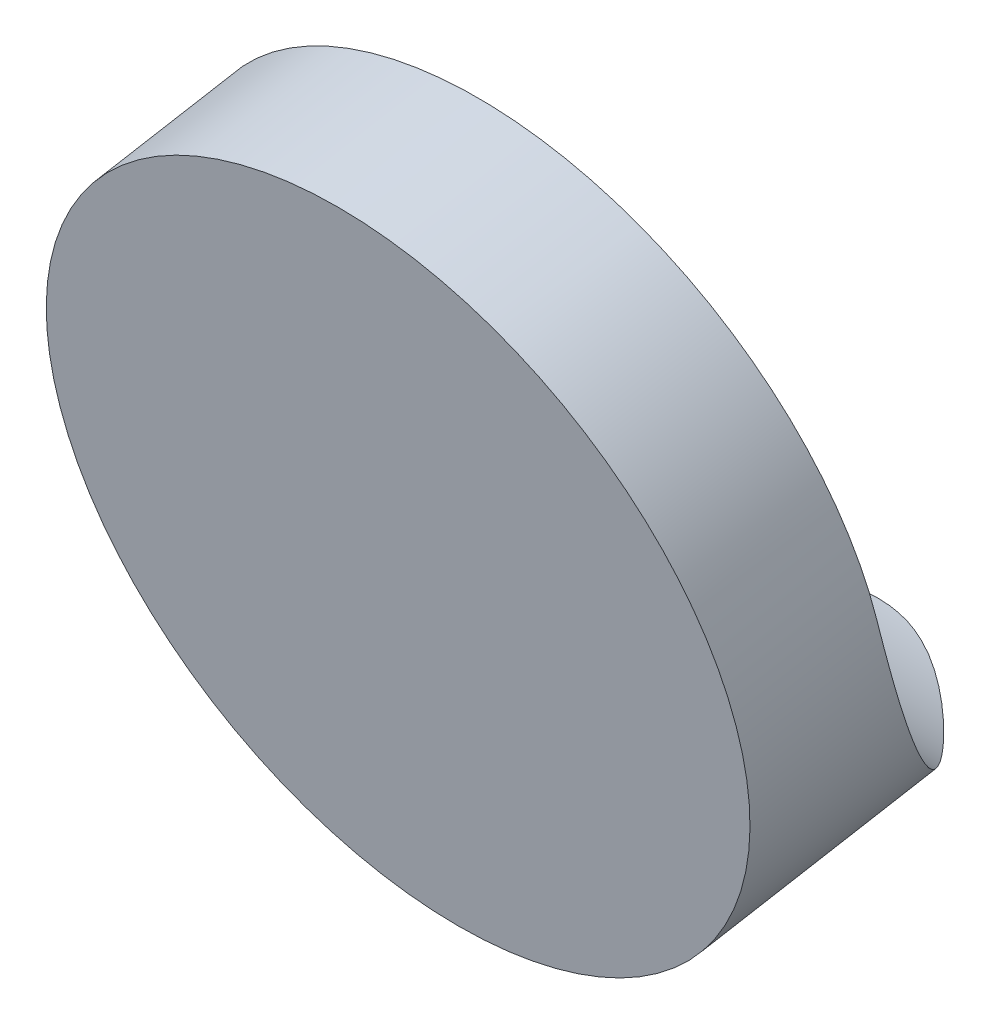
ISO-10303-21;
HEADER;
FILE_DESCRIPTION(('STEP AP214'),'2;1');
FILE_NAME('part.step','',(''),(''),'','','');
FILE_SCHEMA(('AUTOMOTIVE_DESIGN { 1 0 10303 214 1 1 1 1 }'));
ENDSEC;
DATA;
#1=APPLICATION_CONTEXT('core data for automotive mechanical design processes');
#2=APPLICATION_PROTOCOL_DEFINITION('international standard','automotive_design',2000,#1);
#3=PRODUCT_CONTEXT('',#1,'mechanical');
#4=PRODUCT('Part','Part','',(#3));
#5=PRODUCT_RELATED_PRODUCT_CATEGORY('part','',(#4));
#6=PRODUCT_DEFINITION_FORMATION('','',#4);
#7=PRODUCT_DEFINITION_CONTEXT('part definition',#1,'design');
#8=PRODUCT_DEFINITION('design','',#6,#7);
#9=PRODUCT_DEFINITION_SHAPE('','',#8);
#10=(LENGTH_UNIT() NAMED_UNIT(*) SI_UNIT(.MILLI.,.METRE.));
#11=(NAMED_UNIT(*) PLANE_ANGLE_UNIT() SI_UNIT($,.RADIAN.));
#12=(NAMED_UNIT(*) SI_UNIT($,.STERADIAN.) SOLID_ANGLE_UNIT());
#13=UNCERTAINTY_MEASURE_WITH_UNIT(LENGTH_MEASURE(1.E-05),#10,'distance_accuracy_value','');
#14=(GEOMETRIC_REPRESENTATION_CONTEXT(3) GLOBAL_UNCERTAINTY_ASSIGNED_CONTEXT((#13)) GLOBAL_UNIT_ASSIGNED_CONTEXT((#10,
#11,#12)) REPRESENTATION_CONTEXT('',''));
#15=CARTESIAN_POINT('',(0.,0.,0.));
#16=DIRECTION('',(0.,0.,1.));
#17=DIRECTION('',(1.,0.,0.));
#18=AXIS2_PLACEMENT_3D('',#15,#16,#17);
#19=CARTESIAN_POINT('',(0.,88.3379145341021,-14.4271454362242));
#20=DIRECTION('',(0.,-0.173648177666923,0.984807753012209));
#21=DIRECTION('',(0.,-0.984807753012209,-0.173648177666923));
#22=AXIS2_PLACEMENT_3D('',#19,#20,#21);
#23=CYLINDRICAL_SURFACE('',#22,12.1999999999991);
#24=CARTESIAN_POINT('',(0.,85.7331918690982,0.344970858958972));
#25=DIRECTION('',(0.,-0.173648177666923,0.984807753012209));
#26=DIRECTION('',(0.,-0.984807753012209,-0.173648177666923));
#27=AXIS2_PLACEMENT_3D('',#24,#25,#26);
#28=CIRCLE('',#27,12.1999999999991);
#29=CARTESIAN_POINT('',(0.,73.7185372823501,-1.77353690857734));
#30=VERTEX_POINT('',#29);
#31=EDGE_CURVE('E47',#30,#30,#28,.T.);
#32=ORIENTED_EDGE('',*,*,#31,.F.);
#33=EDGE_LOOP('',(#32));
#34=FACE_BOUND('',#33,.T.);
#35=CARTESIAN_POINT('',(-12.1392072190051,87.7993606537095,-4.36784089704516));
#36=CARTESIAN_POINT('',(-12.1532147196582,87.6617115130478,-4.3921102562988));
#37=CARTESIAN_POINT('',(-12.1648023392377,87.5242069828366,-4.41848405272386));
#38=CARTESIAN_POINT('',(-12.1831343314049,87.2497465147514,-4.47541503495586));
#39=CARTESIAN_POINT('',(-12.1898788478009,87.1127905607085,-4.50597209651527));
#40=CARTESIAN_POINT('',(-12.2028369467568,86.7033309161728,-4.60383245392506));
#41=CARTESIAN_POINT('',(-12.2017964778567,86.432024421312,-4.67736207144266));
#42=CARTESIAN_POINT('',(-12.1807432267052,85.896997937094,-4.83978371267855));
#43=CARTESIAN_POINT('',(-12.1608672385769,85.6332373624002,-4.92856119462065));
#44=CARTESIAN_POINT('',(-12.1029964482111,85.1132006475448,-5.12093408547772));
#45=CARTESIAN_POINT('',(-12.0650003523064,84.8569250431519,-5.22453055200966));
#46=CARTESIAN_POINT('',(-11.9719079080006,84.3540838444365,-5.44516344204128));
#47=CARTESIAN_POINT('',(-11.9168458240349,84.1074998995306,-5.56217264195061));
#48=CARTESIAN_POINT('',(-11.7906849013815,83.6247283913672,-5.80856583368056));
#49=CARTESIAN_POINT('',(-11.7195789621823,83.3885454867694,-5.93795528997052));
#50=CARTESIAN_POINT('',(-11.5624738405449,82.9274041591296,-6.20788165959979));
#51=CARTESIAN_POINT('',(-11.4764568473072,82.7024595786483,-6.34843179396612));
#52=CARTESIAN_POINT('',(-11.2908432159911,82.2647382895209,-6.63921468073627));
#53=CARTESIAN_POINT('',(-11.1912435798152,82.0519642820456,-6.78944956698459));
#54=CARTESIAN_POINT('',(-10.9416551262953,81.5647326066916,-7.15385581507834));
#55=CARTESIAN_POINT('',(-10.7864256472619,81.2956070892344,-7.37159186032811));
#56=CARTESIAN_POINT('',(-10.4560702176334,80.7809982511047,-7.81954977623964));
#57=CARTESIAN_POINT('',(-10.2809380189792,80.5355223997054,-8.04977555588238));
#58=CARTESIAN_POINT('',(-9.91300144550046,80.0675941223839,-8.52047225825681));
#59=CARTESIAN_POINT('',(-9.72016163657196,79.8451898440885,-8.7609631842616));
#60=CARTESIAN_POINT('',(-9.31933391960637,79.4234717681597,-9.24932772435853));
#61=CARTESIAN_POINT('',(-9.11134606512789,79.2241578888925,-9.49720131234612));
#62=CARTESIAN_POINT('',(-8.60650453268886,78.7817103189891,-10.0863230773509));
#63=CARTESIAN_POINT('',(-8.30410996503959,78.5477964185715,-10.42976979092));
#64=CARTESIAN_POINT('',(-7.67804531380005,78.1186893138486,-11.121556765579));
#65=CARTESIAN_POINT('',(-7.35436447936685,77.9235158788875,-11.4698994284931));
#66=CARTESIAN_POINT('',(-6.6878997214513,77.5700654107804,-12.1662335599352));
#67=CARTESIAN_POINT('',(-6.3451368774455,77.4117486271407,-12.5142250000115));
#68=CARTESIAN_POINT('',(-5.8165134672815,77.2002950872541,-13.0316524079355));
#69=CARTESIAN_POINT('',(-5.63792334007993,77.1341563395947,-13.2033401117431));
#70=CARTESIAN_POINT('',(-5.27558446252668,77.0102738429707,-13.5442718793158));
#71=CARTESIAN_POINT('',(-5.09183632082159,76.9525291084382,-13.713516227858));
#72=CARTESIAN_POINT('',(-4.74668480757552,76.8532343954932,-14.0232201193758));
#73=CARTESIAN_POINT('',(-4.58606310968275,76.8105544277281,-14.1641900185487));
#74=CARTESIAN_POINT('',(-4.26028923074735,76.7309277551912,-14.4424380218246));
#75=CARTESIAN_POINT('',(-4.09513767385148,76.6939802651932,-14.5797166294217));
#76=CARTESIAN_POINT('',(-3.75951388158822,76.6256344518497,-14.8492853980446));
#77=CARTESIAN_POINT('',(-3.58903863624341,76.5942393371478,-14.9815726401194));
#78=CARTESIAN_POINT('',(-3.24195107930801,76.5368636331836,-15.2390777455546));
#79=CARTESIAN_POINT('',(-3.06533986956069,76.5108820776048,-15.3642968676551));
#80=CARTESIAN_POINT('',(-2.75247960904164,76.4703468550823,-15.5728872969137));
#81=CARTESIAN_POINT('',(-2.61793481937623,76.4545892517229,-15.6585558161919));
#82=CARTESIAN_POINT('',(-2.34430668325694,76.4258318302516,-15.8227864492657));
#83=CARTESIAN_POINT('',(-2.20522205679382,76.4128327978067,-15.9013465348681));
#84=CARTESIAN_POINT('',(-1.7808865671191,76.3779432357145,-16.1227984251094));
#85=CARTESIAN_POINT('',(-1.48755663323038,76.360030686579,-16.252164119243));
#86=CARTESIAN_POINT('',(-0.992550283748176,76.3392285033612,-16.4120328380209));
#87=CARTESIAN_POINT('',(-0.797223959322686,76.3332311537889,-16.461407414295));
#88=CARTESIAN_POINT('',(-0.401203491795373,76.3252520152862,-16.5281580537634));
#89=CARTESIAN_POINT('',(-0.200523385709996,76.3232606051127,-16.5456107759148));
#90=CARTESIAN_POINT('',(0.115810628638701,76.3232595674708,-16.5456777076129));
#91=CARTESIAN_POINT('',(0.231568982493763,76.3239232119778,-16.5398949297691));
#92=CARTESIAN_POINT('',(0.461984245955879,76.3265765083573,-16.5172071708003));
#93=CARTESIAN_POINT('',(0.576640962883281,76.3285663880588,-16.5003002787114));
#94=CARTESIAN_POINT('',(0.91816689471674,76.3365528392362,-16.4340920970007));
#95=CARTESIAN_POINT('',(1.14204824082874,76.3445663047542,-16.3693102229857));
#96=CARTESIAN_POINT('',(1.53369487485018,76.3638600430325,-16.2258630247861));
#97=CARTESIAN_POINT('',(1.70364977414743,76.3741514385332,-16.1526578398676));
#98=CARTESIAN_POINT('',(2.03661780871444,76.3982986517417,-15.9921413800035));
#99=CARTESIAN_POINT('',(2.19962505279264,76.4121574269415,-15.9048184233424));
#100=CARTESIAN_POINT('',(2.51975677611042,76.4435846488423,-15.7196617637248));
#101=CARTESIAN_POINT('',(2.67686162643433,76.4611643707283,-15.6217965687001));
#102=CARTESIAN_POINT('',(2.9856467708908,76.5001243382196,-15.4184915544067));
#103=CARTESIAN_POINT('',(3.1373249662179,76.5215060355865,-15.3130488509083));
#104=CARTESIAN_POINT('',(3.46065462292729,76.5720271737053,-15.0787036353592));
#105=CARTESIAN_POINT('',(3.63146948721318,76.6018645892881,-14.9488019681971));
#106=CARTESIAN_POINT('',(3.96769701001425,76.6669970043188,-14.6835733187136));
#107=CARTESIAN_POINT('',(4.13311009743079,76.7022915691864,-14.548246769038));
#108=CARTESIAN_POINT('',(4.62272910783234,76.8166776112702,-14.1361686769587));
#109=CARTESIAN_POINT('',(4.94004156960469,76.9042288627746,-13.8535239489152));
#110=CARTESIAN_POINT('',(5.55993168092113,77.1031740595901,-13.2799527436829));
#111=CARTESIAN_POINT('',(5.8624914486387,77.2145960981536,-12.9890168615632));
#112=CARTESIAN_POINT('',(6.45363333649872,77.4623934789769,-12.4037962336705));
#113=CARTESIAN_POINT('',(6.7422202161618,77.598760247721,-12.109512670988));
#114=CARTESIAN_POINT('',(7.35421918443571,77.9235729782202,-11.4700110339199));
#115=CARTESIAN_POINT('',(7.67502822856237,78.1169466149961,-11.1247816165374));
#116=CARTESIAN_POINT('',(8.2959783297796,78.5419036592508,-10.4388619228328));
#117=CARTESIAN_POINT('',(8.59611148410627,78.7735015632589,-10.0981734218334));
#118=CARTESIAN_POINT('',(9.17158443907188,79.2760920813437,-9.42717145689885));
#119=CARTESIAN_POINT('',(9.44699545114632,79.5469652557178,-9.09683010350794));
#120=CARTESIAN_POINT('',(9.96946569535358,80.1301925583171,-8.4508118094942));
#121=CARTESIAN_POINT('',(10.2165466487552,80.4425145050576,-8.13512374592003));
#122=CARTESIAN_POINT('',(10.5873004039802,80.9798696043478,-7.64308290693653));
#123=CARTESIAN_POINT('',(10.7216326583525,81.1916928354121,-7.46023372105151));
#124=CARTESIAN_POINT('',(10.9760527353861,81.6310950460804,-7.10384596273683));
#125=CARTESIAN_POINT('',(11.0961449991361,81.8586690781606,-6.93030449676404));
#126=CARTESIAN_POINT('',(11.320467275012,82.3292957664818,-6.59419730050857));
#127=CARTESIAN_POINT('',(11.4246959661313,82.572349709393,-6.43163248491055));
#128=CARTESIAN_POINT('',(11.6155435226899,83.0732118258723,-6.11931819672197));
#129=CARTESIAN_POINT('',(11.7021625238028,83.3310198857482,-5.96956862540185));
#130=CARTESIAN_POINT('',(11.8568384292705,83.8629002344553,-5.68331671683774));
#131=CARTESIAN_POINT('',(11.9246984532991,84.1371108014801,-5.54696390702492));
#132=CARTESIAN_POINT('',(12.0390347215858,84.6976927413023,-5.29110357788109));
#133=CARTESIAN_POINT('',(12.0855073195868,84.9840661786155,-5.17159893333393));
#134=CARTESIAN_POINT('',(12.1555889420292,85.5658919501736,-4.95141637481812));
#135=CARTESIAN_POINT('',(12.1792528540603,85.8613207149817,-4.85069373714255));
#136=CARTESIAN_POINT('',(12.2029422919572,86.458972604113,-4.66910296403905));
#137=CARTESIAN_POINT('',(12.2029872097829,86.7611899508907,-4.58821859529233));
#138=CARTESIAN_POINT('',(12.1862521559688,87.1871695237682,-4.48934308490908));
#139=CARTESIAN_POINT('',(12.1795304971983,87.30943074611,-4.46269283598638));
#140=CARTESIAN_POINT('',(12.1622446655268,87.5542086586161,-4.4127558230143));
#141=CARTESIAN_POINT('',(12.1516852829297,87.6767248418018,-4.38946491619065));
#142=CARTESIAN_POINT('',(12.1392072190051,87.7993606537095,-4.36784089704516));
#143=B_SPLINE_CURVE_WITH_KNOTS('',3,(#35,#36,#37,#38,#39,#40,#41,#42,#43,#44,#45,#46,#47,#48,
#49,#50,#51,#52,#53,#54,#55,#56,#57,#58,#59,#60,#61,#62,#63,#64,#65,#66,#67,#68,#69,#70,#71,#72,
#73,#74,#75,#76,#77,#78,#79,#80,#81,#82,#83,#84,#85,#86,#87,#88,#89,#90,#91,#92,#93,#94,#95,#96,
#97,#98,#99,#100,#101,#102,#103,#104,#105,#106,#107,#108,#109,#110,#111,#112,#113,#114,#115,
#116,#117,#118,#119,#120,#121,#122,#123,#124,#125,#126,#127,#128,#129,#130,#131,#132,#133,#134,
#135,#136,#137,#138,#139,#140,#141,#142),.UNSPECIFIED.,.F.,.F.,(4,2,2,2,2,2,2,2,2,2,2,2,2,2,2,2,
2,2,2,2,2,2,2,2,2,2,2,2,2,2,2,2,2,2,2,2,2,2,2,2,2,2,2,2,2,2,2,2,2,2,2,2,2,4),(0.,
0.42134161326001,0.842670714929282,1.68468536786751,2.52063132772053,3.35663697804372,
4.19097488401445,5.02568276879957,5.86139464462093,6.6972912866496,7.83377021334464,
8.97060690549968,10.1097702330127,11.2489295330063,12.788465182023,14.3287844510138,
15.8674346839593,16.6365043466024,17.4054836372438,18.0591381835533,18.7127031140512,
19.3666445055838,20.0204690688473,20.5010582360684,20.9817840964337,21.9395738953877,
22.542180933774,23.1433389276938,23.4905327721447,23.8377862751142,24.5338981689605,
25.0891814126836,25.6449264981153,26.202380344584,26.7600475103773,27.409780664467,
28.0594621036552,29.3598551825541,30.6617871696381,31.9632725199851,33.4897283569214,
35.0167644371541,36.5392504447937,38.0605612112488,38.9910174109467,39.921182657645,
40.8514253196322,41.7816608143179,42.721317658381,43.6611346415087,44.5986843287752,
45.5354642561475,45.9113185244289,46.2867052480921),.UNSPECIFIED.);
#144=CARTESIAN_POINT('',(-12.1392072190051,87.7993606537095,-4.36784089704516));
#145=VERTEX_POINT('',#144);
#146=CARTESIAN_POINT('',(12.1392072190051,87.7993606537095,-4.36784089704516));
#147=VERTEX_POINT('',#146);
#148=EDGE_CURVE('E57',#145,#147,#143,.T.);
#149=ORIENTED_EDGE('',*,*,#148,.T.);
#150=CARTESIAN_POINT('',(0.,86.6014327574328,-4.57906790610206));
#151=DIRECTION('',(0.,0.173648177666922,-0.984807753012209));
#152=DIRECTION('',(0.,0.98480775301221,0.173648177666922));
#153=AXIS2_PLACEMENT_3D('',#150,#151,#152);
#154=CIRCLE('',#153,12.1999999999991);
#155=EDGE_CURVE('E11',#147,#145,#154,.F.);
#156=ORIENTED_EDGE('',*,*,#155,.T.);
#157=EDGE_LOOP('',(#149,#156));
#158=FACE_BOUND('',#157,.T.);
#159=ADVANCED_FACE('F39',(#34,#158),#23,.T.);
#160=CARTESIAN_POINT('',(0.,85.7331918690982,0.344970858958972));
#161=DIRECTION('',(0.,-0.173648177666923,0.984807753012209));
#162=DIRECTION('',(0.,-0.984807753012209,-0.173648177666923));
#163=AXIS2_PLACEMENT_3D('',#160,#161,#162);
#164=PLANE('',#163);
#165=ORIENTED_EDGE('',*,*,#31,.T.);
#166=EDGE_LOOP('',(#165));
#167=FACE_BOUND('',#166,.T.);
#168=ADVANCED_FACE('F71',(#167),#164,.T.);
#169=CARTESIAN_POINT('',(25.,90.2304351410464,-18.1551494392161));
#170=DIRECTION('',(-1.,0.,0.));
#171=DIRECTION('',(0.,0.,1.));
#172=AXIS2_PLACEMENT_3D('',#169,#170,#171);
#173=CYLINDRICAL_SURFACE('',#172,14.);
#174=ORIENTED_EDGE('',*,*,#148,.F.);
#175=DIRECTION('',(-1.,0.,0.));
#176=VECTOR('',#175,1.);
#177=CARTESIAN_POINT('',(25.,87.7993606537095,-4.36784089704516));
#178=LINE('',#177,#176);
#179=EDGE_CURVE('E53',#147,#145,#178,.T.);
#180=ORIENTED_EDGE('',*,*,#179,.F.);
#181=EDGE_LOOP('',(#174,#180));
#182=FACE_BOUND('',#181,.T.);
#183=ADVANCED_FACE('F61',(#182),#173,.F.);
#184=CARTESIAN_POINT('',(25.,87.7993606537095,-4.36784089704516));
#185=DIRECTION('',(0.,0.173648177666922,-0.984807753012209));
#186=DIRECTION('',(0.,0.98480775301221,0.173648177666922));
#187=AXIS2_PLACEMENT_3D('',#184,#185,#186);
#188=PLANE('',#187);
#189=ORIENTED_EDGE('',*,*,#179,.T.);
#190=ORIENTED_EDGE('',*,*,#155,.F.);
#191=EDGE_LOOP('',(#189,#190));
#192=FACE_BOUND('',#191,.T.);
#193=ADVANCED_FACE('F60',(#192),#188,.T.);
#194=CLOSED_SHELL('',(#159,#168,#183,#193));
#195=MANIFOLD_SOLID_BREP('B2',#194);
#196=ADVANCED_BREP_SHAPE_REPRESENTATION('',(#18,#195),#14);
#197=SHAPE_DEFINITION_REPRESENTATION(#9,#196);
ENDSEC;
END-ISO-10303-21;
